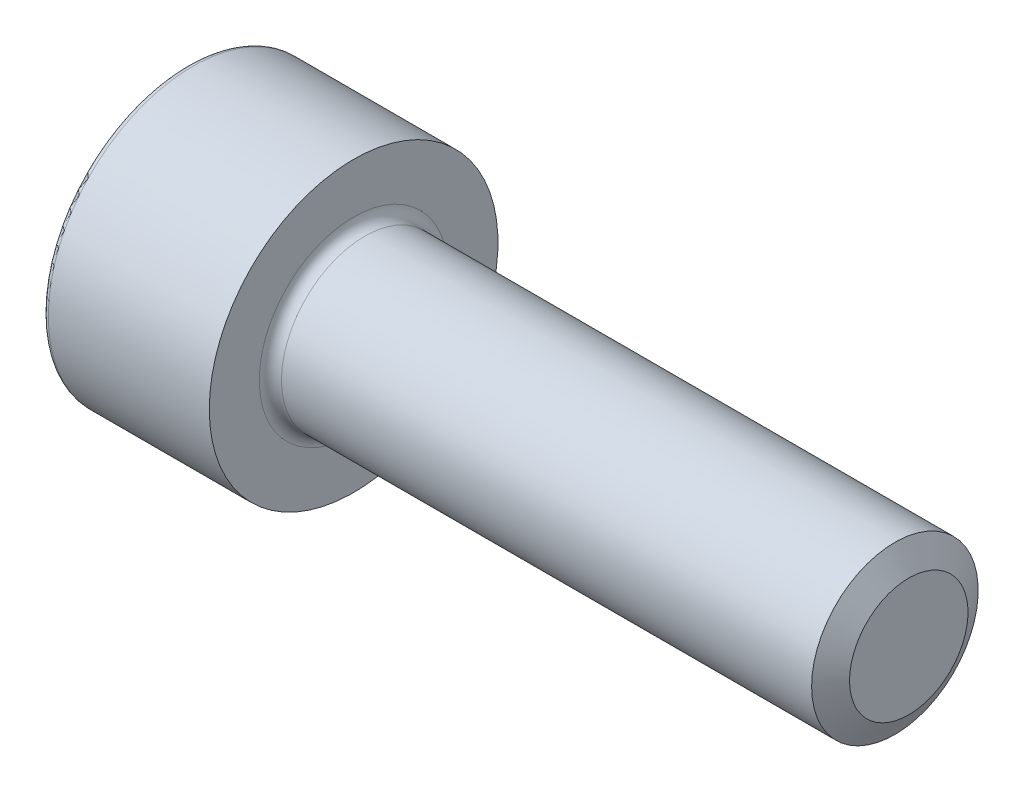
ISO-10303-21;
HEADER;
FILE_DESCRIPTION(('STEP AP214'),'2;1');
FILE_NAME('part.step','',(''),(''),'','','');
FILE_SCHEMA(('AUTOMOTIVE_DESIGN { 1 0 10303 214 1 1 1 1 }'));
ENDSEC;
DATA;
#1=APPLICATION_CONTEXT('core data for automotive mechanical design processes');
#2=APPLICATION_PROTOCOL_DEFINITION('international standard','automotive_design',2000,#1);
#3=PRODUCT_CONTEXT('',#1,'mechanical');
#4=PRODUCT('Part','Part','',(#3));
#5=PRODUCT_RELATED_PRODUCT_CATEGORY('part','',(#4));
#6=PRODUCT_DEFINITION_FORMATION('','',#4);
#7=PRODUCT_DEFINITION_CONTEXT('part definition',#1,'design');
#8=PRODUCT_DEFINITION('design','',#6,#7);
#9=PRODUCT_DEFINITION_SHAPE('','',#8);
#10=(LENGTH_UNIT() NAMED_UNIT(*) SI_UNIT(.MILLI.,.METRE.));
#11=(NAMED_UNIT(*) PLANE_ANGLE_UNIT() SI_UNIT($,.RADIAN.));
#12=(NAMED_UNIT(*) SI_UNIT($,.STERADIAN.) SOLID_ANGLE_UNIT());
#13=UNCERTAINTY_MEASURE_WITH_UNIT(LENGTH_MEASURE(1.E-05),#10,'distance_accuracy_value','');
#14=(GEOMETRIC_REPRESENTATION_CONTEXT(3) GLOBAL_UNCERTAINTY_ASSIGNED_CONTEXT((#13)) GLOBAL_UNIT_ASSIGNED_CONTEXT((#10,
#11,#12)) REPRESENTATION_CONTEXT('',''));
#15=CARTESIAN_POINT('',(0.,0.,0.));
#16=DIRECTION('',(0.,0.,1.));
#17=DIRECTION('',(1.,0.,0.));
#18=AXIS2_PLACEMENT_3D('',#15,#16,#17);
#19=CARTESIAN_POINT('',(0.,0.,0.));
#20=DIRECTION('',(-1.,0.,0.));
#21=DIRECTION('',(0.,0.,1.));
#22=AXIS2_PLACEMENT_3D('',#19,#20,#21);
#23=CYLINDRICAL_SURFACE('',#22,1.5);
#24=CARTESIAN_POINT('',(3.2,0.,0.));
#25=DIRECTION('',(-1.,0.,0.));
#26=DIRECTION('',(0.,0.,1.));
#27=AXIS2_PLACEMENT_3D('',#24,#25,#26);
#28=CIRCLE('',#27,1.5);
#29=CARTESIAN_POINT('',(3.2,0.,1.5));
#30=VERTEX_POINT('',#29);
#31=EDGE_CURVE('E142',#30,#30,#28,.T.);
#32=ORIENTED_EDGE('',*,*,#31,.F.);
#33=EDGE_LOOP('',(#32));
#34=FACE_BOUND('',#33,.T.);
#35=CARTESIAN_POINT('',(12.7500073334409,0.,0.));
#36=DIRECTION('',(-1.,0.,0.));
#37=DIRECTION('',(0.,0.,1.));
#38=AXIS2_PLACEMENT_3D('',#35,#36,#37);
#39=CIRCLE('',#38,1.5);
#40=CARTESIAN_POINT('',(12.7500073334409,0.,1.5));
#41=VERTEX_POINT('',#40);
#42=EDGE_CURVE('E279',#41,#41,#39,.T.);
#43=ORIENTED_EDGE('',*,*,#42,.T.);
#44=EDGE_LOOP('',(#43));
#45=FACE_BOUND('',#44,.T.);
#46=ADVANCED_FACE('F39',(#34,#45),#23,.T.);
#47=CARTESIAN_POINT('',(0.,0.,0.));
#48=DIRECTION('',(1.,0.,0.));
#49=DIRECTION('',(0.,0.,-1.));
#50=AXIS2_PLACEMENT_3D('',#47,#48,#49);
#51=PLANE('',#50);
#52=CARTESIAN_POINT('',(0.,0.,0.));
#53=DIRECTION('',(1.,0.,0.));
#54=DIRECTION('',(0.,0.,-1.));
#55=AXIS2_PLACEMENT_3D('',#52,#53,#54);
#56=CIRCLE('',#55,2.5);
#57=CARTESIAN_POINT('',(0.,0.,-2.5));
#58=VERTEX_POINT('',#57);
#59=EDGE_CURVE('E47',#58,#58,#56,.F.);
#60=ORIENTED_EDGE('',*,*,#59,.T.);
#61=EDGE_LOOP('',(#60));
#62=FACE_BOUND('',#61,.T.);
#63=DIRECTION('',(0.,0.866025403784439,-0.5));
#64=VECTOR('',#63,1.);
#65=CARTESIAN_POINT('',(0.,0.,1.435));
#66=LINE('',#65,#64);
#67=CARTESIAN_POINT('',(0.,0.,1.435));
#68=VERTEX_POINT('',#67);
#69=CARTESIAN_POINT('',(0.,1.24274645443067,0.717499999999999));
#70=VERTEX_POINT('',#69);
#71=EDGE_CURVE('E128',#68,#70,#66,.T.);
#72=ORIENTED_EDGE('',*,*,#71,.F.);
#73=DIRECTION('',(0.,0.866025403784439,0.5));
#74=VECTOR('',#73,1.);
#75=CARTESIAN_POINT('',(0.,-1.24274645443067,0.7175));
#76=LINE('',#75,#74);
#77=CARTESIAN_POINT('',(0.,-1.24274645443067,0.7175));
#78=VERTEX_POINT('',#77);
#79=EDGE_CURVE('E54',#78,#68,#76,.T.);
#80=ORIENTED_EDGE('',*,*,#79,.F.);
#81=DIRECTION('',(0.,0.,1.));
#82=VECTOR('',#81,1.);
#83=CARTESIAN_POINT('',(0.,-1.24274645443067,-0.7175));
#84=LINE('',#83,#82);
#85=CARTESIAN_POINT('',(0.,-1.24274645443067,-0.7175));
#86=VERTEX_POINT('',#85);
#87=EDGE_CURVE('E138',#86,#78,#84,.T.);
#88=ORIENTED_EDGE('',*,*,#87,.F.);
#89=DIRECTION('',(0.,-0.866025403784439,0.5));
#90=VECTOR('',#89,1.);
#91=CARTESIAN_POINT('',(0.,0.,-1.435));
#92=LINE('',#91,#90);
#93=CARTESIAN_POINT('',(0.,0.,-1.435));
#94=VERTEX_POINT('',#93);
#95=EDGE_CURVE('E136',#94,#86,#92,.T.);
#96=ORIENTED_EDGE('',*,*,#95,.F.);
#97=DIRECTION('',(0.,-0.866025403784439,-0.5));
#98=VECTOR('',#97,1.);
#99=CARTESIAN_POINT('',(0.,1.24274645443067,-0.7175));
#100=LINE('',#99,#98);
#101=CARTESIAN_POINT('',(0.,1.24274645443067,-0.7175));
#102=VERTEX_POINT('',#101);
#103=EDGE_CURVE('E102',#102,#94,#100,.T.);
#104=ORIENTED_EDGE('',*,*,#103,.F.);
#105=DIRECTION('',(0.,0.,-1.));
#106=VECTOR('',#105,1.);
#107=CARTESIAN_POINT('',(0.,1.24274645443067,0.717499999999999));
#108=LINE('',#107,#106);
#109=EDGE_CURVE('E132',#70,#102,#108,.T.);
#110=ORIENTED_EDGE('',*,*,#109,.F.);
#111=EDGE_LOOP('',(#72,#80,#88,#96,#104,#110));
#112=FACE_BOUND('',#111,.T.);
#113=ADVANCED_FACE('F159',(#62,#112),#51,.F.);
#114=CARTESIAN_POINT('',(0.,0.,0.));
#115=DIRECTION('',(-1.,0.,0.));
#116=DIRECTION('',(0.,0.,1.));
#117=AXIS2_PLACEMENT_3D('',#114,#115,#116);
#118=CYLINDRICAL_SURFACE('',#117,2.6);
#119=CARTESIAN_POINT('',(0.1,0.,0.));
#120=DIRECTION('',(1.,0.,0.));
#121=DIRECTION('',(0.,0.,-1.));
#122=AXIS2_PLACEMENT_3D('',#119,#120,#121);
#123=CIRCLE('',#122,2.6);
#124=CARTESIAN_POINT('',(0.1,0.,-2.6));
#125=VERTEX_POINT('',#124);
#126=EDGE_CURVE('E11',#125,#125,#123,.T.);
#127=ORIENTED_EDGE('',*,*,#126,.T.);
#128=EDGE_LOOP('',(#127));
#129=FACE_BOUND('',#128,.T.);
#130=CARTESIAN_POINT('',(3.,0.,0.));
#131=DIRECTION('',(-1.,0.,0.));
#132=DIRECTION('',(0.,0.,1.));
#133=AXIS2_PLACEMENT_3D('',#130,#131,#132);
#134=CIRCLE('',#133,2.6);
#135=CARTESIAN_POINT('',(3.,0.,2.6));
#136=VERTEX_POINT('',#135);
#137=EDGE_CURVE('E153',#136,#136,#134,.T.);
#138=ORIENTED_EDGE('',*,*,#137,.T.);
#139=EDGE_LOOP('',(#138));
#140=FACE_BOUND('',#139,.T.);
#141=ADVANCED_FACE('F178',(#129,#140),#118,.T.);
#142=CARTESIAN_POINT('',(3.,2.6,0.));
#143=DIRECTION('',(-1.,0.,0.));
#144=DIRECTION('',(0.,0.,1.));
#145=AXIS2_PLACEMENT_3D('',#142,#143,#144);
#146=PLANE('',#145);
#147=ORIENTED_EDGE('',*,*,#137,.F.);
#148=EDGE_LOOP('',(#147));
#149=FACE_BOUND('',#148,.T.);
#150=CARTESIAN_POINT('',(3.,0.,0.));
#151=DIRECTION('',(-1.,0.,0.));
#152=DIRECTION('',(0.,0.,1.));
#153=AXIS2_PLACEMENT_3D('',#150,#151,#152);
#154=CIRCLE('',#153,1.7);
#155=CARTESIAN_POINT('',(3.,0.,1.7));
#156=VERTEX_POINT('',#155);
#157=EDGE_CURVE('E150',#156,#156,#154,.T.);
#158=ORIENTED_EDGE('',*,*,#157,.T.);
#159=EDGE_LOOP('',(#158));
#160=FACE_BOUND('',#159,.T.);
#161=ADVANCED_FACE('F187',(#149,#160),#146,.F.);
#162=CARTESIAN_POINT('',(3.2,0.,0.));
#163=DIRECTION('',(-1.,0.,0.));
#164=DIRECTION('',(0.,0.,1.));
#165=AXIS2_PLACEMENT_3D('',#162,#163,#164);
#166=TOROIDAL_SURFACE('',#165,1.7,0.2);
#167=ORIENTED_EDGE('',*,*,#157,.F.);
#168=EDGE_LOOP('',(#167));
#169=FACE_BOUND('',#168,.T.);
#170=ORIENTED_EDGE('',*,*,#31,.T.);
#171=EDGE_LOOP('',(#170));
#172=FACE_BOUND('',#171,.T.);
#173=ADVANCED_FACE('F183',(#169,#172),#166,.F.);
#174=CARTESIAN_POINT('',(1.3,-1.24274645443067,0.7175));
#175=DIRECTION('',(0.,-0.5,0.866025403784439));
#176=DIRECTION('',(0.,-0.866025403784439,-0.5));
#177=AXIS2_PLACEMENT_3D('',#174,#175,#176);
#178=PLANE('',#177);
#179=ORIENTED_EDGE('',*,*,#79,.T.);
#180=DIRECTION('',(-1.,0.,0.));
#181=VECTOR('',#180,1.);
#182=CARTESIAN_POINT('',(1.3,0.,1.435));
#183=LINE('',#182,#181);
#184=CARTESIAN_POINT('',(1.3,0.,1.435));
#185=VERTEX_POINT('',#184);
#186=EDGE_CURVE('E84',#185,#68,#183,.T.);
#187=ORIENTED_EDGE('',*,*,#186,.F.);
#188=DIRECTION('',(0.,0.866025403784439,0.5));
#189=VECTOR('',#188,1.);
#190=CARTESIAN_POINT('',(1.3,-1.24274645443067,0.7175));
#191=LINE('',#190,#189);
#192=CARTESIAN_POINT('',(1.3,-1.24274645443067,0.7175));
#193=VERTEX_POINT('',#192);
#194=EDGE_CURVE('E140',#193,#185,#191,.T.);
#195=ORIENTED_EDGE('',*,*,#194,.F.);
#196=DIRECTION('',(-1.,0.,0.));
#197=VECTOR('',#196,1.);
#198=CARTESIAN_POINT('',(1.3,-1.24274645443067,0.7175));
#199=LINE('',#198,#197);
#200=EDGE_CURVE('E62',#193,#78,#199,.T.);
#201=ORIENTED_EDGE('',*,*,#200,.T.);
#202=EDGE_LOOP('',(#179,#187,#195,#201));
#203=FACE_BOUND('',#202,.T.);
#204=ADVANCED_FACE('F186',(#203),#178,.F.);
#205=CARTESIAN_POINT('',(1.3,-1.24274645443067,-0.7175));
#206=DIRECTION('',(0.,-1.,0.));
#207=DIRECTION('',(0.,0.,-1.));
#208=AXIS2_PLACEMENT_3D('',#205,#206,#207);
#209=PLANE('',#208);
#210=ORIENTED_EDGE('',*,*,#87,.T.);
#211=ORIENTED_EDGE('',*,*,#200,.F.);
#212=DIRECTION('',(0.,0.,1.));
#213=VECTOR('',#212,1.);
#214=CARTESIAN_POINT('',(1.3,-1.24274645443067,-0.7175));
#215=LINE('',#214,#213);
#216=CARTESIAN_POINT('',(1.3,-1.24274645443067,-0.7175));
#217=VERTEX_POINT('',#216);
#218=EDGE_CURVE('E114',#217,#193,#215,.T.);
#219=ORIENTED_EDGE('',*,*,#218,.F.);
#220=DIRECTION('',(-1.,0.,0.));
#221=VECTOR('',#220,1.);
#222=CARTESIAN_POINT('',(1.3,-1.24274645443067,-0.7175));
#223=LINE('',#222,#221);
#224=EDGE_CURVE('E106',#217,#86,#223,.T.);
#225=ORIENTED_EDGE('',*,*,#224,.T.);
#226=EDGE_LOOP('',(#210,#211,#219,#225));
#227=FACE_BOUND('',#226,.T.);
#228=ADVANCED_FACE('F217',(#227),#209,.F.);
#229=CARTESIAN_POINT('',(1.3,0.,-1.435));
#230=DIRECTION('',(0.,-0.5,-0.866025403784439));
#231=DIRECTION('',(0.,0.866025403784439,-0.5));
#232=AXIS2_PLACEMENT_3D('',#229,#230,#231);
#233=PLANE('',#232);
#234=ORIENTED_EDGE('',*,*,#95,.T.);
#235=ORIENTED_EDGE('',*,*,#224,.F.);
#236=DIRECTION('',(0.,-0.866025403784439,0.5));
#237=VECTOR('',#236,1.);
#238=CARTESIAN_POINT('',(1.3,0.,-1.435));
#239=LINE('',#238,#237);
#240=CARTESIAN_POINT('',(1.3,0.,-1.435));
#241=VERTEX_POINT('',#240);
#242=EDGE_CURVE('E110',#241,#217,#239,.T.);
#243=ORIENTED_EDGE('',*,*,#242,.F.);
#244=DIRECTION('',(-1.,0.,0.));
#245=VECTOR('',#244,1.);
#246=CARTESIAN_POINT('',(1.3,0.,-1.435));
#247=LINE('',#246,#245);
#248=EDGE_CURVE('E95',#241,#94,#247,.T.);
#249=ORIENTED_EDGE('',*,*,#248,.T.);
#250=EDGE_LOOP('',(#234,#235,#243,#249));
#251=FACE_BOUND('',#250,.T.);
#252=ADVANCED_FACE('F111',(#251),#233,.F.);
#253=CARTESIAN_POINT('',(1.3,1.24274645443067,-0.7175));
#254=DIRECTION('',(0.,0.5,-0.866025403784439));
#255=DIRECTION('',(0.,0.866025403784439,0.5));
#256=AXIS2_PLACEMENT_3D('',#253,#254,#255);
#257=PLANE('',#256);
#258=ORIENTED_EDGE('',*,*,#103,.T.);
#259=ORIENTED_EDGE('',*,*,#248,.F.);
#260=DIRECTION('',(0.,-0.866025403784439,-0.5));
#261=VECTOR('',#260,1.);
#262=CARTESIAN_POINT('',(1.3,1.24274645443067,-0.7175));
#263=LINE('',#262,#261);
#264=CARTESIAN_POINT('',(1.3,1.24274645443067,-0.7175));
#265=VERTEX_POINT('',#264);
#266=EDGE_CURVE('E99',#265,#241,#263,.T.);
#267=ORIENTED_EDGE('',*,*,#266,.F.);
#268=DIRECTION('',(-1.,0.,0.));
#269=VECTOR('',#268,1.);
#270=CARTESIAN_POINT('',(1.3,1.24274645443067,-0.7175));
#271=LINE('',#270,#269);
#272=EDGE_CURVE('E107',#265,#102,#271,.T.);
#273=ORIENTED_EDGE('',*,*,#272,.T.);
#274=EDGE_LOOP('',(#258,#259,#267,#273));
#275=FACE_BOUND('',#274,.T.);
#276=ADVANCED_FACE('F97',(#275),#257,.F.);
#277=CARTESIAN_POINT('',(1.3,1.24274645443067,0.717499999999999));
#278=DIRECTION('',(0.,1.,0.));
#279=DIRECTION('',(0.,0.,1.));
#280=AXIS2_PLACEMENT_3D('',#277,#278,#279);
#281=PLANE('',#280);
#282=ORIENTED_EDGE('',*,*,#109,.T.);
#283=ORIENTED_EDGE('',*,*,#272,.F.);
#284=DIRECTION('',(0.,0.,-1.));
#285=VECTOR('',#284,1.);
#286=CARTESIAN_POINT('',(1.3,1.24274645443067,0.717499999999999));
#287=LINE('',#286,#285);
#288=CARTESIAN_POINT('',(1.3,1.24274645443067,0.717499999999999));
#289=VERTEX_POINT('',#288);
#290=EDGE_CURVE('E120',#289,#265,#287,.T.);
#291=ORIENTED_EDGE('',*,*,#290,.F.);
#292=DIRECTION('',(-1.,0.,0.));
#293=VECTOR('',#292,1.);
#294=CARTESIAN_POINT('',(1.3,1.24274645443067,0.717499999999999));
#295=LINE('',#294,#293);
#296=EDGE_CURVE('E145',#289,#70,#295,.T.);
#297=ORIENTED_EDGE('',*,*,#296,.T.);
#298=EDGE_LOOP('',(#282,#283,#291,#297));
#299=FACE_BOUND('',#298,.T.);
#300=ADVANCED_FACE('F235',(#299),#281,.F.);
#301=CARTESIAN_POINT('',(1.3,0.,1.435));
#302=DIRECTION('',(0.,0.5,0.866025403784439));
#303=DIRECTION('',(0.,-0.866025403784439,0.5));
#304=AXIS2_PLACEMENT_3D('',#301,#302,#303);
#305=PLANE('',#304);
#306=ORIENTED_EDGE('',*,*,#71,.T.);
#307=ORIENTED_EDGE('',*,*,#296,.F.);
#308=DIRECTION('',(0.,0.866025403784439,-0.5));
#309=VECTOR('',#308,1.);
#310=CARTESIAN_POINT('',(1.3,0.,1.435));
#311=LINE('',#310,#309);
#312=EDGE_CURVE('E122',#185,#289,#311,.T.);
#313=ORIENTED_EDGE('',*,*,#312,.F.);
#314=ORIENTED_EDGE('',*,*,#186,.T.);
#315=EDGE_LOOP('',(#306,#307,#313,#314));
#316=FACE_BOUND('',#315,.T.);
#317=ADVANCED_FACE('F242',(#316),#305,.F.);
#318=CARTESIAN_POINT('',(1.3,-1.24274645443067,0.7175));
#319=DIRECTION('',(1.,0.,0.));
#320=DIRECTION('',(0.,0.,-1.));
#321=AXIS2_PLACEMENT_3D('',#318,#319,#320);
#322=PLANE('',#321);
#323=ORIENTED_EDGE('',*,*,#194,.T.);
#324=ORIENTED_EDGE('',*,*,#312,.T.);
#325=ORIENTED_EDGE('',*,*,#290,.T.);
#326=ORIENTED_EDGE('',*,*,#266,.T.);
#327=ORIENTED_EDGE('',*,*,#242,.T.);
#328=ORIENTED_EDGE('',*,*,#218,.T.);
#329=EDGE_LOOP('',(#323,#324,#325,#326,#327,#328));
#330=FACE_BOUND('',#329,.T.);
#331=ADVANCED_FACE('F117',(#330),#322,.F.);
#332=CARTESIAN_POINT('',(12.7500073334409,0.,0.));
#333=DIRECTION('',(-1.,0.,0.));
#334=DIRECTION('',(0.,0.,1.));
#335=AXIS2_PLACEMENT_3D('',#332,#333,#334);
#336=CONICAL_SURFACE('',#335,1.5,1.0471975511966);
#337=CARTESIAN_POINT('',(13.,0.,0.));
#338=DIRECTION('',(-1.,0.,0.));
#339=DIRECTION('',(0.,0.,1.));
#340=AXIS2_PLACEMENT_3D('',#337,#338,#339);
#341=CIRCLE('',#340,1.067);
#342=CARTESIAN_POINT('',(13.,0.,1.067));
#343=VERTEX_POINT('',#342);
#344=EDGE_CURVE('E129',#343,#343,#341,.T.);
#345=ORIENTED_EDGE('',*,*,#344,.T.);
#346=EDGE_LOOP('',(#345));
#347=FACE_BOUND('',#346,.T.);
#348=ORIENTED_EDGE('',*,*,#42,.F.);
#349=EDGE_LOOP('',(#348));
#350=FACE_BOUND('',#349,.T.);
#351=ADVANCED_FACE('F168',(#347,#350),#336,.T.);
#352=CARTESIAN_POINT('',(13.,1.5,0.));
#353=DIRECTION('',(-1.,0.,0.));
#354=DIRECTION('',(0.,0.,1.));
#355=AXIS2_PLACEMENT_3D('',#352,#353,#354);
#356=PLANE('',#355);
#357=ORIENTED_EDGE('',*,*,#344,.F.);
#358=EDGE_LOOP('',(#357));
#359=FACE_BOUND('',#358,.T.);
#360=ADVANCED_FACE('F163',(#359),#356,.F.);
#361=CARTESIAN_POINT('',(0.1,0.,0.));
#362=DIRECTION('',(1.,0.,0.));
#363=DIRECTION('',(0.,0.,-1.));
#364=AXIS2_PLACEMENT_3D('',#361,#362,#363);
#365=TOROIDAL_SURFACE('',#364,2.5,0.1);
#366=ORIENTED_EDGE('',*,*,#126,.F.);
#367=EDGE_LOOP('',(#366));
#368=FACE_BOUND('',#367,.T.);
#369=ORIENTED_EDGE('',*,*,#59,.F.);
#370=EDGE_LOOP('',(#369));
#371=FACE_BOUND('',#370,.T.);
#372=ADVANCED_FACE('F41',(#368,#371),#365,.T.);
#373=CLOSED_SHELL('',(#46,#113,#141,#161,#173,#204,#228,#252,#276,#300,#317,#331,#351,#360,#372));
#374=MANIFOLD_SOLID_BREP('B2',#373);
#375=ADVANCED_BREP_SHAPE_REPRESENTATION('',(#18,#374),#14);
#376=SHAPE_DEFINITION_REPRESENTATION(#9,#375);
ENDSEC;
END-ISO-10303-21;
